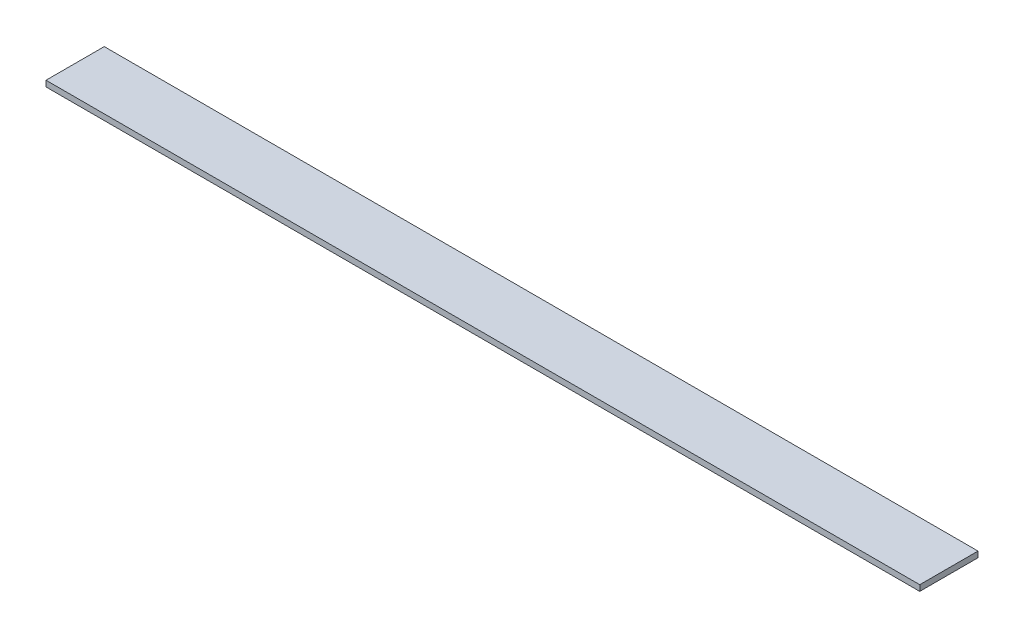
ISO-10303-21;
HEADER;
FILE_DESCRIPTION(('STEP AP214'),'2;1');
FILE_NAME('part.step','',(''),(''),'','','');
FILE_SCHEMA(('AUTOMOTIVE_DESIGN { 1 0 10303 214 1 1 1 1 }'));
ENDSEC;
DATA;
#1=APPLICATION_CONTEXT('core data for automotive mechanical design processes');
#2=APPLICATION_PROTOCOL_DEFINITION('international standard','automotive_design',2000,#1);
#3=PRODUCT_CONTEXT('',#1,'mechanical');
#4=PRODUCT('Part','Part','',(#3));
#5=PRODUCT_RELATED_PRODUCT_CATEGORY('part','',(#4));
#6=PRODUCT_DEFINITION_FORMATION('','',#4);
#7=PRODUCT_DEFINITION_CONTEXT('part definition',#1,'design');
#8=PRODUCT_DEFINITION('design','',#6,#7);
#9=PRODUCT_DEFINITION_SHAPE('','',#8);
#10=(LENGTH_UNIT() NAMED_UNIT(*) SI_UNIT(.MILLI.,.METRE.));
#11=(NAMED_UNIT(*) PLANE_ANGLE_UNIT() SI_UNIT($,.RADIAN.));
#12=(NAMED_UNIT(*) SI_UNIT($,.STERADIAN.) SOLID_ANGLE_UNIT());
#13=UNCERTAINTY_MEASURE_WITH_UNIT(LENGTH_MEASURE(1.E-05),#10,'distance_accuracy_value','');
#14=(GEOMETRIC_REPRESENTATION_CONTEXT(3) GLOBAL_UNCERTAINTY_ASSIGNED_CONTEXT((#13)) GLOBAL_UNIT_ASSIGNED_CONTEXT((#10,
#11,#12)) REPRESENTATION_CONTEXT('',''));
#15=CARTESIAN_POINT('',(0.,0.,0.));
#16=DIRECTION('',(0.,0.,1.));
#17=DIRECTION('',(1.,0.,0.));
#18=AXIS2_PLACEMENT_3D('',#15,#16,#17);
#19=CARTESIAN_POINT('',(0.,3.,0.));
#20=DIRECTION('',(1.,0.,0.));
#21=DIRECTION('',(0.,0.,-1.));
#22=AXIS2_PLACEMENT_3D('',#19,#20,#21);
#23=PLANE('',#22);
#24=DIRECTION('',(0.,0.,1.));
#25=VECTOR('',#24,1.);
#26=CARTESIAN_POINT('',(0.,0.,0.));
#27=LINE('',#26,#25);
#28=CARTESIAN_POINT('',(0.,0.,-30.));
#29=VERTEX_POINT('',#28);
#30=CARTESIAN_POINT('',(0.,0.,0.));
#31=VERTEX_POINT('',#30);
#32=EDGE_CURVE('E98',#29,#31,#27,.T.);
#33=ORIENTED_EDGE('',*,*,#32,.T.);
#34=DIRECTION('',(0.,-1.,0.));
#35=VECTOR('',#34,1.);
#36=CARTESIAN_POINT('',(0.,3.,0.));
#37=LINE('',#36,#35);
#38=CARTESIAN_POINT('',(0.,3.,0.));
#39=VERTEX_POINT('',#38);
#40=EDGE_CURVE('E11',#39,#31,#37,.T.);
#41=ORIENTED_EDGE('',*,*,#40,.F.);
#42=DIRECTION('',(0.,0.,1.));
#43=VECTOR('',#42,1.);
#44=CARTESIAN_POINT('',(0.,3.,0.));
#45=LINE('',#44,#43);
#46=CARTESIAN_POINT('',(0.,3.,-30.));
#47=VERTEX_POINT('',#46);
#48=EDGE_CURVE('E86',#47,#39,#45,.T.);
#49=ORIENTED_EDGE('',*,*,#48,.F.);
#50=DIRECTION('',(0.,-1.,0.));
#51=VECTOR('',#50,1.);
#52=CARTESIAN_POINT('',(0.,3.,-30.));
#53=LINE('',#52,#51);
#54=EDGE_CURVE('E94',#47,#29,#53,.T.);
#55=ORIENTED_EDGE('',*,*,#54,.T.);
#56=EDGE_LOOP('',(#33,#41,#49,#55));
#57=FACE_BOUND('',#56,.T.);
#58=ADVANCED_FACE('F35',(#57),#23,.F.);
#59=CARTESIAN_POINT('',(0.,3.,0.));
#60=DIRECTION('',(0.,0.,-1.));
#61=DIRECTION('',(-1.,0.,0.));
#62=AXIS2_PLACEMENT_3D('',#59,#60,#61);
#63=PLANE('',#62);
#64=DIRECTION('',(1.,0.,0.));
#65=VECTOR('',#64,1.);
#66=CARTESIAN_POINT('',(0.,0.,0.));
#67=LINE('',#66,#65);
#68=CARTESIAN_POINT('',(450.,0.,0.));
#69=VERTEX_POINT('',#68);
#70=EDGE_CURVE('E90',#31,#69,#67,.T.);
#71=ORIENTED_EDGE('',*,*,#70,.T.);
#72=DIRECTION('',(0.,-1.,0.));
#73=VECTOR('',#72,1.);
#74=CARTESIAN_POINT('',(450.,3.,0.));
#75=LINE('',#74,#73);
#76=CARTESIAN_POINT('',(450.,3.,0.));
#77=VERTEX_POINT('',#76);
#78=EDGE_CURVE('E43',#77,#69,#75,.T.);
#79=ORIENTED_EDGE('',*,*,#78,.F.);
#80=DIRECTION('',(1.,0.,0.));
#81=VECTOR('',#80,1.);
#82=CARTESIAN_POINT('',(0.,3.,0.));
#83=LINE('',#82,#81);
#84=EDGE_CURVE('E81',#39,#77,#83,.T.);
#85=ORIENTED_EDGE('',*,*,#84,.F.);
#86=ORIENTED_EDGE('',*,*,#40,.T.);
#87=EDGE_LOOP('',(#71,#79,#85,#86));
#88=FACE_BOUND('',#87,.T.);
#89=ADVANCED_FACE('F89',(#88),#63,.F.);
#90=CARTESIAN_POINT('',(450.,3.,0.));
#91=DIRECTION('',(-1.,0.,0.));
#92=DIRECTION('',(0.,0.,1.));
#93=AXIS2_PLACEMENT_3D('',#90,#91,#92);
#94=PLANE('',#93);
#95=DIRECTION('',(0.,0.,-1.));
#96=VECTOR('',#95,1.);
#97=CARTESIAN_POINT('',(450.,0.,0.));
#98=LINE('',#97,#96);
#99=CARTESIAN_POINT('',(450.,0.,-30.));
#100=VERTEX_POINT('',#99);
#101=EDGE_CURVE('E68',#69,#100,#98,.T.);
#102=ORIENTED_EDGE('',*,*,#101,.T.);
#103=DIRECTION('',(0.,-1.,0.));
#104=VECTOR('',#103,1.);
#105=CARTESIAN_POINT('',(450.,3.,-30.));
#106=LINE('',#105,#104);
#107=CARTESIAN_POINT('',(450.,3.,-30.));
#108=VERTEX_POINT('',#107);
#109=EDGE_CURVE('E91',#108,#100,#106,.T.);
#110=ORIENTED_EDGE('',*,*,#109,.F.);
#111=DIRECTION('',(0.,0.,-1.));
#112=VECTOR('',#111,1.);
#113=CARTESIAN_POINT('',(450.,3.,0.));
#114=LINE('',#113,#112);
#115=EDGE_CURVE('E84',#77,#108,#114,.T.);
#116=ORIENTED_EDGE('',*,*,#115,.F.);
#117=ORIENTED_EDGE('',*,*,#78,.T.);
#118=EDGE_LOOP('',(#102,#110,#116,#117));
#119=FACE_BOUND('',#118,.T.);
#120=ADVANCED_FACE('F92',(#119),#94,.F.);
#121=CARTESIAN_POINT('',(0.,3.,-30.));
#122=DIRECTION('',(0.,0.,1.));
#123=DIRECTION('',(1.,0.,0.));
#124=AXIS2_PLACEMENT_3D('',#121,#122,#123);
#125=PLANE('',#124);
#126=DIRECTION('',(-1.,0.,0.));
#127=VECTOR('',#126,1.);
#128=CARTESIAN_POINT('',(0.,0.,-30.));
#129=LINE('',#128,#127);
#130=EDGE_CURVE('E74',#100,#29,#129,.T.);
#131=ORIENTED_EDGE('',*,*,#130,.T.);
#132=ORIENTED_EDGE('',*,*,#54,.F.);
#133=DIRECTION('',(-1.,0.,0.));
#134=VECTOR('',#133,1.);
#135=CARTESIAN_POINT('',(0.,3.,-30.));
#136=LINE('',#135,#134);
#137=EDGE_CURVE('E51',#108,#47,#136,.T.);
#138=ORIENTED_EDGE('',*,*,#137,.F.);
#139=ORIENTED_EDGE('',*,*,#109,.T.);
#140=EDGE_LOOP('',(#131,#132,#138,#139));
#141=FACE_BOUND('',#140,.T.);
#142=ADVANCED_FACE('F105',(#141),#125,.F.);
#143=CARTESIAN_POINT('',(0.,3.,0.));
#144=DIRECTION('',(0.,-1.,0.));
#145=DIRECTION('',(0.,0.,-1.));
#146=AXIS2_PLACEMENT_3D('',#143,#144,#145);
#147=PLANE('',#146);
#148=ORIENTED_EDGE('',*,*,#48,.T.);
#149=ORIENTED_EDGE('',*,*,#84,.T.);
#150=ORIENTED_EDGE('',*,*,#115,.T.);
#151=ORIENTED_EDGE('',*,*,#137,.T.);
#152=EDGE_LOOP('',(#148,#149,#150,#151));
#153=FACE_BOUND('',#152,.T.);
#154=ADVANCED_FACE('F82',(#153),#147,.F.);
#155=CARTESIAN_POINT('',(0.,0.,0.));
#156=DIRECTION('',(0.,-1.,0.));
#157=DIRECTION('',(0.,0.,-1.));
#158=AXIS2_PLACEMENT_3D('',#155,#156,#157);
#159=PLANE('',#158);
#160=ORIENTED_EDGE('',*,*,#32,.F.);
#161=ORIENTED_EDGE('',*,*,#130,.F.);
#162=ORIENTED_EDGE('',*,*,#101,.F.);
#163=ORIENTED_EDGE('',*,*,#70,.F.);
#164=EDGE_LOOP('',(#160,#161,#162,#163));
#165=FACE_BOUND('',#164,.T.);
#166=ADVANCED_FACE('F108',(#165),#159,.T.);
#167=CLOSED_SHELL('',(#58,#89,#120,#142,#154,#166));
#168=MANIFOLD_SOLID_BREP('B2',#167);
#169=ADVANCED_BREP_SHAPE_REPRESENTATION('',(#18,#168),#14);
#170=SHAPE_DEFINITION_REPRESENTATION(#9,#169);
ENDSEC;
END-ISO-10303-21;
